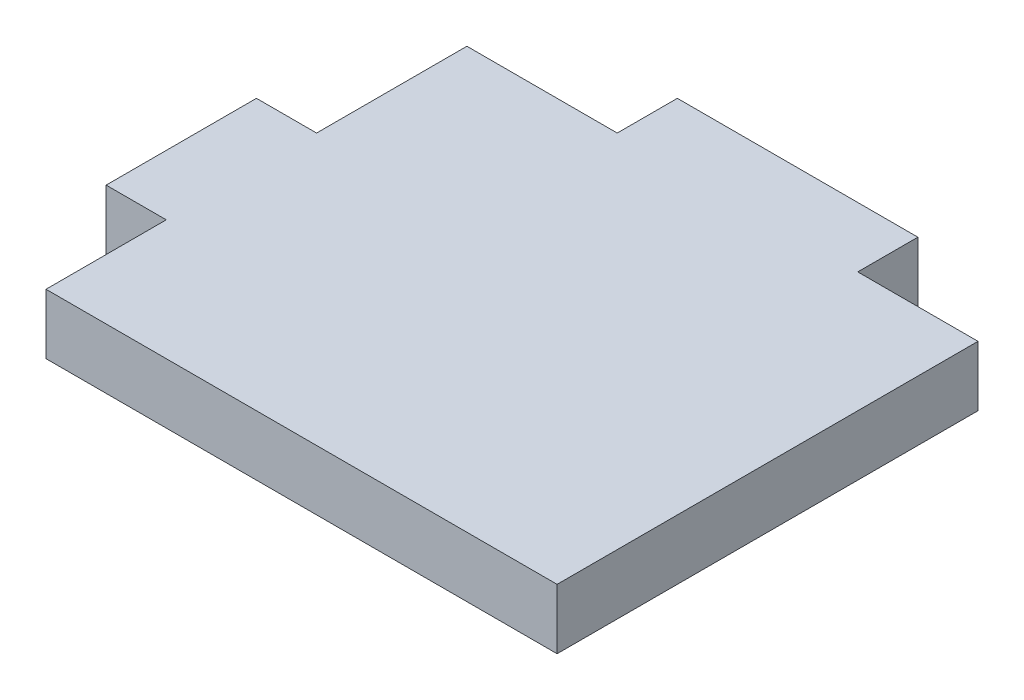
ISO-10303-21;
HEADER;
FILE_DESCRIPTION(('STEP AP214'),'2;1');
FILE_NAME('part.step','',(''),(''),'','','');
FILE_SCHEMA(('AUTOMOTIVE_DESIGN { 1 0 10303 214 1 1 1 1 }'));
ENDSEC;
DATA;
#1=APPLICATION_CONTEXT('core data for automotive mechanical design processes');
#2=APPLICATION_PROTOCOL_DEFINITION('international standard','automotive_design',2000,#1);
#3=PRODUCT_CONTEXT('',#1,'mechanical');
#4=PRODUCT('Part','Part','',(#3));
#5=PRODUCT_RELATED_PRODUCT_CATEGORY('part','',(#4));
#6=PRODUCT_DEFINITION_FORMATION('','',#4);
#7=PRODUCT_DEFINITION_CONTEXT('part definition',#1,'design');
#8=PRODUCT_DEFINITION('design','',#6,#7);
#9=PRODUCT_DEFINITION_SHAPE('','',#8);
#10=(LENGTH_UNIT() NAMED_UNIT(*) SI_UNIT(.MILLI.,.METRE.));
#11=(NAMED_UNIT(*) PLANE_ANGLE_UNIT() SI_UNIT($,.RADIAN.));
#12=(NAMED_UNIT(*) SI_UNIT($,.STERADIAN.) SOLID_ANGLE_UNIT());
#13=UNCERTAINTY_MEASURE_WITH_UNIT(LENGTH_MEASURE(1.E-05),#10,'distance_accuracy_value','');
#14=(GEOMETRIC_REPRESENTATION_CONTEXT(3) GLOBAL_UNCERTAINTY_ASSIGNED_CONTEXT((#13)) GLOBAL_UNIT_ASSIGNED_CONTEXT((#10,
#11,#12)) REPRESENTATION_CONTEXT('',''));
#15=CARTESIAN_POINT('',(0.,0.,0.));
#16=DIRECTION('',(0.,0.,1.));
#17=DIRECTION('',(1.,0.,0.));
#18=AXIS2_PLACEMENT_3D('',#15,#16,#17);
#19=CARTESIAN_POINT('',(95.,10.,0.));
#20=DIRECTION('',(-1.,0.,0.));
#21=DIRECTION('',(0.,0.,1.));
#22=AXIS2_PLACEMENT_3D('',#19,#20,#21);
#23=PLANE('',#22);
#24=DIRECTION('',(0.,0.,-1.));
#25=VECTOR('',#24,1.);
#26=CARTESIAN_POINT('',(95.,0.,0.));
#27=LINE('',#26,#25);
#28=CARTESIAN_POINT('',(95.,0.,0.));
#29=VERTEX_POINT('',#28);
#30=CARTESIAN_POINT('',(95.,0.,-70.0000000000001));
#31=VERTEX_POINT('',#30);
#32=EDGE_CURVE('E156',#29,#31,#27,.T.);
#33=ORIENTED_EDGE('',*,*,#32,.T.);
#34=DIRECTION('',(0.,-1.,0.));
#35=VECTOR('',#34,1.);
#36=CARTESIAN_POINT('',(95.,10.,-70.0000000000001));
#37=LINE('',#36,#35);
#38=CARTESIAN_POINT('',(95.,10.,-70.0000000000001));
#39=VERTEX_POINT('',#38);
#40=EDGE_CURVE('E11',#39,#31,#37,.T.);
#41=ORIENTED_EDGE('',*,*,#40,.F.);
#42=DIRECTION('',(0.,0.,-1.));
#43=VECTOR('',#42,1.);
#44=CARTESIAN_POINT('',(95.,10.,0.));
#45=LINE('',#44,#43);
#46=CARTESIAN_POINT('',(95.,10.,0.));
#47=VERTEX_POINT('',#46);
#48=EDGE_CURVE('E178',#47,#39,#45,.T.);
#49=ORIENTED_EDGE('',*,*,#48,.F.);
#50=DIRECTION('',(0.,-1.,0.));
#51=VECTOR('',#50,1.);
#52=CARTESIAN_POINT('',(95.,10.,0.));
#53=LINE('',#52,#51);
#54=EDGE_CURVE('E152',#47,#29,#53,.T.);
#55=ORIENTED_EDGE('',*,*,#54,.T.);
#56=EDGE_LOOP('',(#33,#41,#49,#55));
#57=FACE_BOUND('',#56,.T.);
#58=ADVANCED_FACE('F36',(#57),#23,.F.);
#59=CARTESIAN_POINT('',(75.,10.,-70.));
#60=DIRECTION('',(0.,0.,1.));
#61=DIRECTION('',(1.,0.,0.));
#62=AXIS2_PLACEMENT_3D('',#59,#60,#61);
#63=PLANE('',#62);
#64=DIRECTION('',(-1.,0.,0.));
#65=VECTOR('',#64,1.);
#66=CARTESIAN_POINT('',(75.,0.,-70.));
#67=LINE('',#66,#65);
#68=CARTESIAN_POINT('',(75.,0.,-70.));
#69=VERTEX_POINT('',#68);
#70=EDGE_CURVE('E159',#31,#69,#67,.T.);
#71=ORIENTED_EDGE('',*,*,#70,.T.);
#72=DIRECTION('',(0.,-1.,0.));
#73=VECTOR('',#72,1.);
#74=CARTESIAN_POINT('',(75.,10.,-70.));
#75=LINE('',#74,#73);
#76=CARTESIAN_POINT('',(75.,10.,-70.));
#77=VERTEX_POINT('',#76);
#78=EDGE_CURVE('E44',#77,#69,#75,.T.);
#79=ORIENTED_EDGE('',*,*,#78,.F.);
#80=DIRECTION('',(-1.,0.,0.));
#81=VECTOR('',#80,1.);
#82=CARTESIAN_POINT('',(75.,10.,-70.));
#83=LINE('',#82,#81);
#84=EDGE_CURVE('E107',#39,#77,#83,.T.);
#85=ORIENTED_EDGE('',*,*,#84,.F.);
#86=ORIENTED_EDGE('',*,*,#40,.T.);
#87=EDGE_LOOP('',(#71,#79,#85,#86));
#88=FACE_BOUND('',#87,.T.);
#89=ADVANCED_FACE('F256',(#88),#63,.F.);
#90=CARTESIAN_POINT('',(75.,10.,-80.));
#91=DIRECTION('',(-1.,0.,0.));
#92=DIRECTION('',(0.,0.,1.));
#93=AXIS2_PLACEMENT_3D('',#90,#91,#92);
#94=PLANE('',#93);
#95=DIRECTION('',(0.,0.,-1.));
#96=VECTOR('',#95,1.);
#97=CARTESIAN_POINT('',(75.,0.,-80.));
#98=LINE('',#97,#96);
#99=CARTESIAN_POINT('',(75.,0.,-80.));
#100=VERTEX_POINT('',#99);
#101=EDGE_CURVE('E161',#69,#100,#98,.T.);
#102=ORIENTED_EDGE('',*,*,#101,.T.);
#103=DIRECTION('',(0.,-1.,0.));
#104=VECTOR('',#103,1.);
#105=CARTESIAN_POINT('',(75.,10.,-80.));
#106=LINE('',#105,#104);
#107=CARTESIAN_POINT('',(75.,10.,-80.));
#108=VERTEX_POINT('',#107);
#109=EDGE_CURVE('E197',#108,#100,#106,.T.);
#110=ORIENTED_EDGE('',*,*,#109,.F.);
#111=DIRECTION('',(0.,0.,-1.));
#112=VECTOR('',#111,1.);
#113=CARTESIAN_POINT('',(75.,10.,-80.));
#114=LINE('',#113,#112);
#115=EDGE_CURVE('E205',#77,#108,#114,.T.);
#116=ORIENTED_EDGE('',*,*,#115,.F.);
#117=ORIENTED_EDGE('',*,*,#78,.T.);
#118=EDGE_LOOP('',(#102,#110,#116,#117));
#119=FACE_BOUND('',#118,.T.);
#120=ADVANCED_FACE('F203',(#119),#94,.F.);
#121=CARTESIAN_POINT('',(35.,10.,-80.));
#122=DIRECTION('',(0.,0.,1.));
#123=DIRECTION('',(1.,0.,0.));
#124=AXIS2_PLACEMENT_3D('',#121,#122,#123);
#125=PLANE('',#124);
#126=DIRECTION('',(-1.,0.,0.));
#127=VECTOR('',#126,1.);
#128=CARTESIAN_POINT('',(35.,0.,-80.));
#129=LINE('',#128,#127);
#130=CARTESIAN_POINT('',(35.,0.,-80.));
#131=VERTEX_POINT('',#130);
#132=EDGE_CURVE('E163',#100,#131,#129,.T.);
#133=ORIENTED_EDGE('',*,*,#132,.T.);
#134=DIRECTION('',(0.,-1.,0.));
#135=VECTOR('',#134,1.);
#136=CARTESIAN_POINT('',(35.,10.,-80.));
#137=LINE('',#136,#135);
#138=CARTESIAN_POINT('',(35.,10.,-80.));
#139=VERTEX_POINT('',#138);
#140=EDGE_CURVE('E194',#139,#131,#137,.T.);
#141=ORIENTED_EDGE('',*,*,#140,.F.);
#142=DIRECTION('',(-1.,0.,0.));
#143=VECTOR('',#142,1.);
#144=CARTESIAN_POINT('',(35.,10.,-80.));
#145=LINE('',#144,#143);
#146=EDGE_CURVE('E223',#108,#139,#145,.T.);
#147=ORIENTED_EDGE('',*,*,#146,.F.);
#148=ORIENTED_EDGE('',*,*,#109,.T.);
#149=EDGE_LOOP('',(#133,#141,#147,#148));
#150=FACE_BOUND('',#149,.T.);
#151=ADVANCED_FACE('F214',(#150),#125,.F.);
#152=CARTESIAN_POINT('',(35.,10.,-70.));
#153=DIRECTION('',(1.,0.,0.));
#154=DIRECTION('',(0.,0.,-1.));
#155=AXIS2_PLACEMENT_3D('',#152,#153,#154);
#156=PLANE('',#155);
#157=DIRECTION('',(0.,0.,1.));
#158=VECTOR('',#157,1.);
#159=CARTESIAN_POINT('',(35.,0.,-70.));
#160=LINE('',#159,#158);
#161=CARTESIAN_POINT('',(35.,0.,-70.));
#162=VERTEX_POINT('',#161);
#163=EDGE_CURVE('E165',#131,#162,#160,.T.);
#164=ORIENTED_EDGE('',*,*,#163,.T.);
#165=DIRECTION('',(0.,-1.,0.));
#166=VECTOR('',#165,1.);
#167=CARTESIAN_POINT('',(35.,10.,-70.));
#168=LINE('',#167,#166);
#169=CARTESIAN_POINT('',(35.,10.,-70.));
#170=VERTEX_POINT('',#169);
#171=EDGE_CURVE('E191',#170,#162,#168,.T.);
#172=ORIENTED_EDGE('',*,*,#171,.F.);
#173=DIRECTION('',(0.,0.,1.));
#174=VECTOR('',#173,1.);
#175=CARTESIAN_POINT('',(35.,10.,-70.));
#176=LINE('',#175,#174);
#177=EDGE_CURVE('E220',#139,#170,#176,.T.);
#178=ORIENTED_EDGE('',*,*,#177,.F.);
#179=ORIENTED_EDGE('',*,*,#140,.T.);
#180=EDGE_LOOP('',(#164,#172,#178,#179));
#181=FACE_BOUND('',#180,.T.);
#182=ADVANCED_FACE('F218',(#181),#156,.F.);
#183=CARTESIAN_POINT('',(10.,10.,-70.));
#184=DIRECTION('',(0.,0.,1.));
#185=DIRECTION('',(1.,0.,0.));
#186=AXIS2_PLACEMENT_3D('',#183,#184,#185);
#187=PLANE('',#186);
#188=DIRECTION('',(-1.,0.,0.));
#189=VECTOR('',#188,1.);
#190=CARTESIAN_POINT('',(10.,0.,-70.));
#191=LINE('',#190,#189);
#192=CARTESIAN_POINT('',(10.,0.,-70.));
#193=VERTEX_POINT('',#192);
#194=EDGE_CURVE('E167',#162,#193,#191,.T.);
#195=ORIENTED_EDGE('',*,*,#194,.T.);
#196=DIRECTION('',(0.,-1.,0.));
#197=VECTOR('',#196,1.);
#198=CARTESIAN_POINT('',(10.,10.,-70.));
#199=LINE('',#198,#197);
#200=CARTESIAN_POINT('',(10.,10.,-70.));
#201=VERTEX_POINT('',#200);
#202=EDGE_CURVE('E188',#201,#193,#199,.T.);
#203=ORIENTED_EDGE('',*,*,#202,.F.);
#204=DIRECTION('',(-1.,0.,0.));
#205=VECTOR('',#204,1.);
#206=CARTESIAN_POINT('',(10.,10.,-70.));
#207=LINE('',#206,#205);
#208=EDGE_CURVE('E222',#170,#201,#207,.T.);
#209=ORIENTED_EDGE('',*,*,#208,.F.);
#210=ORIENTED_EDGE('',*,*,#171,.T.);
#211=EDGE_LOOP('',(#195,#203,#209,#210));
#212=FACE_BOUND('',#211,.T.);
#213=ADVANCED_FACE('F269',(#212),#187,.F.);
#214=CARTESIAN_POINT('',(10.,10.,-45.));
#215=DIRECTION('',(1.,0.,0.));
#216=DIRECTION('',(0.,0.,-1.));
#217=AXIS2_PLACEMENT_3D('',#214,#215,#216);
#218=PLANE('',#217);
#219=DIRECTION('',(0.,0.,1.));
#220=VECTOR('',#219,1.);
#221=CARTESIAN_POINT('',(10.,0.,-45.));
#222=LINE('',#221,#220);
#223=CARTESIAN_POINT('',(10.,0.,-45.));
#224=VERTEX_POINT('',#223);
#225=EDGE_CURVE('E169',#193,#224,#222,.T.);
#226=ORIENTED_EDGE('',*,*,#225,.T.);
#227=DIRECTION('',(0.,-1.,0.));
#228=VECTOR('',#227,1.);
#229=CARTESIAN_POINT('',(10.,10.,-45.));
#230=LINE('',#229,#228);
#231=CARTESIAN_POINT('',(10.,10.,-45.));
#232=VERTEX_POINT('',#231);
#233=EDGE_CURVE('E185',#232,#224,#230,.T.);
#234=ORIENTED_EDGE('',*,*,#233,.F.);
#235=DIRECTION('',(0.,0.,1.));
#236=VECTOR('',#235,1.);
#237=CARTESIAN_POINT('',(10.,10.,-45.));
#238=LINE('',#237,#236);
#239=EDGE_CURVE('E225',#201,#232,#238,.T.);
#240=ORIENTED_EDGE('',*,*,#239,.F.);
#241=ORIENTED_EDGE('',*,*,#202,.T.);
#242=EDGE_LOOP('',(#226,#234,#240,#241));
#243=FACE_BOUND('',#242,.T.);
#244=ADVANCED_FACE('F272',(#243),#218,.F.);
#245=CARTESIAN_POINT('',(0.,10.,-45.));
#246=DIRECTION('',(0.,0.,1.));
#247=DIRECTION('',(1.,0.,0.));
#248=AXIS2_PLACEMENT_3D('',#245,#246,#247);
#249=PLANE('',#248);
#250=DIRECTION('',(-1.,0.,0.));
#251=VECTOR('',#250,1.);
#252=CARTESIAN_POINT('',(0.,0.,-45.));
#253=LINE('',#252,#251);
#254=CARTESIAN_POINT('',(0.,0.,-45.));
#255=VERTEX_POINT('',#254);
#256=EDGE_CURVE('E171',#224,#255,#253,.T.);
#257=ORIENTED_EDGE('',*,*,#256,.T.);
#258=DIRECTION('',(0.,-1.,0.));
#259=VECTOR('',#258,1.);
#260=CARTESIAN_POINT('',(0.,10.,-45.));
#261=LINE('',#260,#259);
#262=CARTESIAN_POINT('',(0.,10.,-45.));
#263=VERTEX_POINT('',#262);
#264=EDGE_CURVE('E182',#263,#255,#261,.T.);
#265=ORIENTED_EDGE('',*,*,#264,.F.);
#266=DIRECTION('',(-1.,0.,0.));
#267=VECTOR('',#266,1.);
#268=CARTESIAN_POINT('',(0.,10.,-45.));
#269=LINE('',#268,#267);
#270=EDGE_CURVE('E231',#232,#263,#269,.T.);
#271=ORIENTED_EDGE('',*,*,#270,.F.);
#272=ORIENTED_EDGE('',*,*,#233,.T.);
#273=EDGE_LOOP('',(#257,#265,#271,#272));
#274=FACE_BOUND('',#273,.T.);
#275=ADVANCED_FACE('F237',(#274),#249,.F.);
#276=CARTESIAN_POINT('',(0.,10.,-20.));
#277=DIRECTION('',(1.,0.,0.));
#278=DIRECTION('',(0.,0.,-1.));
#279=AXIS2_PLACEMENT_3D('',#276,#277,#278);
#280=PLANE('',#279);
#281=DIRECTION('',(0.,0.,1.));
#282=VECTOR('',#281,1.);
#283=CARTESIAN_POINT('',(0.,0.,-20.));
#284=LINE('',#283,#282);
#285=CARTESIAN_POINT('',(0.,0.,-20.));
#286=VERTEX_POINT('',#285);
#287=EDGE_CURVE('E173',#255,#286,#284,.T.);
#288=ORIENTED_EDGE('',*,*,#287,.T.);
#289=DIRECTION('',(0.,-1.,0.));
#290=VECTOR('',#289,1.);
#291=CARTESIAN_POINT('',(0.,10.,-20.));
#292=LINE('',#291,#290);
#293=CARTESIAN_POINT('',(0.,10.,-20.));
#294=VERTEX_POINT('',#293);
#295=EDGE_CURVE('E147',#294,#286,#292,.T.);
#296=ORIENTED_EDGE('',*,*,#295,.F.);
#297=DIRECTION('',(0.,0.,1.));
#298=VECTOR('',#297,1.);
#299=CARTESIAN_POINT('',(0.,10.,-20.));
#300=LINE('',#299,#298);
#301=EDGE_CURVE('E138',#263,#294,#300,.T.);
#302=ORIENTED_EDGE('',*,*,#301,.F.);
#303=ORIENTED_EDGE('',*,*,#264,.T.);
#304=EDGE_LOOP('',(#288,#296,#302,#303));
#305=FACE_BOUND('',#304,.T.);
#306=ADVANCED_FACE('F241',(#305),#280,.F.);
#307=CARTESIAN_POINT('',(10.,10.,-20.));
#308=DIRECTION('',(0.,0.,-1.));
#309=DIRECTION('',(-1.,0.,0.));
#310=AXIS2_PLACEMENT_3D('',#307,#308,#309);
#311=PLANE('',#310);
#312=DIRECTION('',(1.,0.,0.));
#313=VECTOR('',#312,1.);
#314=CARTESIAN_POINT('',(10.,0.,-20.));
#315=LINE('',#314,#313);
#316=CARTESIAN_POINT('',(10.,0.,-20.));
#317=VERTEX_POINT('',#316);
#318=EDGE_CURVE('E146',#286,#317,#315,.T.);
#319=ORIENTED_EDGE('',*,*,#318,.T.);
#320=DIRECTION('',(0.,-1.,0.));
#321=VECTOR('',#320,1.);
#322=CARTESIAN_POINT('',(10.,10.,-20.));
#323=LINE('',#322,#321);
#324=CARTESIAN_POINT('',(10.,10.,-20.));
#325=VERTEX_POINT('',#324);
#326=EDGE_CURVE('E143',#325,#317,#323,.T.);
#327=ORIENTED_EDGE('',*,*,#326,.F.);
#328=DIRECTION('',(1.,0.,0.));
#329=VECTOR('',#328,1.);
#330=CARTESIAN_POINT('',(10.,10.,-20.));
#331=LINE('',#330,#329);
#332=EDGE_CURVE('E132',#294,#325,#331,.T.);
#333=ORIENTED_EDGE('',*,*,#332,.F.);
#334=ORIENTED_EDGE('',*,*,#295,.T.);
#335=EDGE_LOOP('',(#319,#327,#333,#334));
#336=FACE_BOUND('',#335,.T.);
#337=ADVANCED_FACE('F144',(#336),#311,.F.);
#338=CARTESIAN_POINT('',(10.,10.,0.));
#339=DIRECTION('',(1.,0.,0.));
#340=DIRECTION('',(0.,0.,-1.));
#341=AXIS2_PLACEMENT_3D('',#338,#339,#340);
#342=PLANE('',#341);
#343=DIRECTION('',(0.,0.,1.));
#344=VECTOR('',#343,1.);
#345=CARTESIAN_POINT('',(10.,0.,0.));
#346=LINE('',#345,#344);
#347=CARTESIAN_POINT('',(10.,0.,0.));
#348=VERTEX_POINT('',#347);
#349=EDGE_CURVE('E93',#317,#348,#346,.T.);
#350=ORIENTED_EDGE('',*,*,#349,.T.);
#351=DIRECTION('',(0.,-1.,0.));
#352=VECTOR('',#351,1.);
#353=CARTESIAN_POINT('',(10.,10.,0.));
#354=LINE('',#353,#352);
#355=CARTESIAN_POINT('',(10.,10.,0.));
#356=VERTEX_POINT('',#355);
#357=EDGE_CURVE('E148',#356,#348,#354,.T.);
#358=ORIENTED_EDGE('',*,*,#357,.F.);
#359=DIRECTION('',(0.,0.,1.));
#360=VECTOR('',#359,1.);
#361=CARTESIAN_POINT('',(10.,10.,0.));
#362=LINE('',#361,#360);
#363=EDGE_CURVE('E136',#325,#356,#362,.T.);
#364=ORIENTED_EDGE('',*,*,#363,.F.);
#365=ORIENTED_EDGE('',*,*,#326,.T.);
#366=EDGE_LOOP('',(#350,#358,#364,#365));
#367=FACE_BOUND('',#366,.T.);
#368=ADVANCED_FACE('F150',(#367),#342,.F.);
#369=CARTESIAN_POINT('',(95.,10.,0.));
#370=DIRECTION('',(0.,0.,-1.));
#371=DIRECTION('',(-1.,0.,0.));
#372=AXIS2_PLACEMENT_3D('',#369,#370,#371);
#373=PLANE('',#372);
#374=DIRECTION('',(1.,0.,0.));
#375=VECTOR('',#374,1.);
#376=CARTESIAN_POINT('',(95.,0.,0.));
#377=LINE('',#376,#375);
#378=EDGE_CURVE('E99',#348,#29,#377,.T.);
#379=ORIENTED_EDGE('',*,*,#378,.T.);
#380=ORIENTED_EDGE('',*,*,#54,.F.);
#381=DIRECTION('',(1.,0.,0.));
#382=VECTOR('',#381,1.);
#383=CARTESIAN_POINT('',(95.,10.,0.));
#384=LINE('',#383,#382);
#385=EDGE_CURVE('E52',#356,#47,#384,.T.);
#386=ORIENTED_EDGE('',*,*,#385,.F.);
#387=ORIENTED_EDGE('',*,*,#357,.T.);
#388=EDGE_LOOP('',(#379,#380,#386,#387));
#389=FACE_BOUND('',#388,.T.);
#390=ADVANCED_FACE('F245',(#389),#373,.F.);
#391=CARTESIAN_POINT('',(0.,10.,0.));
#392=DIRECTION('',(0.,-1.,0.));
#393=DIRECTION('',(0.,0.,-1.));
#394=AXIS2_PLACEMENT_3D('',#391,#392,#393);
#395=PLANE('',#394);
#396=ORIENTED_EDGE('',*,*,#48,.T.);
#397=ORIENTED_EDGE('',*,*,#84,.T.);
#398=ORIENTED_EDGE('',*,*,#115,.T.);
#399=ORIENTED_EDGE('',*,*,#146,.T.);
#400=ORIENTED_EDGE('',*,*,#177,.T.);
#401=ORIENTED_EDGE('',*,*,#208,.T.);
#402=ORIENTED_EDGE('',*,*,#239,.T.);
#403=ORIENTED_EDGE('',*,*,#270,.T.);
#404=ORIENTED_EDGE('',*,*,#301,.T.);
#405=ORIENTED_EDGE('',*,*,#332,.T.);
#406=ORIENTED_EDGE('',*,*,#363,.T.);
#407=ORIENTED_EDGE('',*,*,#385,.T.);
#408=EDGE_LOOP('',(#396,#397,#398,#399,#400,#401,#402,#403,#404,#405,#406,#407));
#409=FACE_BOUND('',#408,.T.);
#410=ADVANCED_FACE('F134',(#409),#395,.F.);
#411=CARTESIAN_POINT('',(0.,0.,0.));
#412=DIRECTION('',(0.,-1.,0.));
#413=DIRECTION('',(0.,0.,-1.));
#414=AXIS2_PLACEMENT_3D('',#411,#412,#413);
#415=PLANE('',#414);
#416=ORIENTED_EDGE('',*,*,#32,.F.);
#417=ORIENTED_EDGE('',*,*,#378,.F.);
#418=ORIENTED_EDGE('',*,*,#349,.F.);
#419=ORIENTED_EDGE('',*,*,#318,.F.);
#420=ORIENTED_EDGE('',*,*,#287,.F.);
#421=ORIENTED_EDGE('',*,*,#256,.F.);
#422=ORIENTED_EDGE('',*,*,#225,.F.);
#423=ORIENTED_EDGE('',*,*,#194,.F.);
#424=ORIENTED_EDGE('',*,*,#163,.F.);
#425=ORIENTED_EDGE('',*,*,#132,.F.);
#426=ORIENTED_EDGE('',*,*,#101,.F.);
#427=ORIENTED_EDGE('',*,*,#70,.F.);
#428=EDGE_LOOP('',(#416,#417,#418,#419,#420,#421,#422,#423,#424,#425,#426,#427));
#429=FACE_BOUND('',#428,.T.);
#430=ADVANCED_FACE('F209',(#429),#415,.T.);
#431=CLOSED_SHELL('',(#58,#89,#120,#151,#182,#213,#244,#275,#306,#337,#368,#390,#410,#430));
#432=MANIFOLD_SOLID_BREP('B2',#431);
#433=ADVANCED_BREP_SHAPE_REPRESENTATION('',(#18,#432),#14);
#434=SHAPE_DEFINITION_REPRESENTATION(#9,#433);
ENDSEC;
END-ISO-10303-21;
